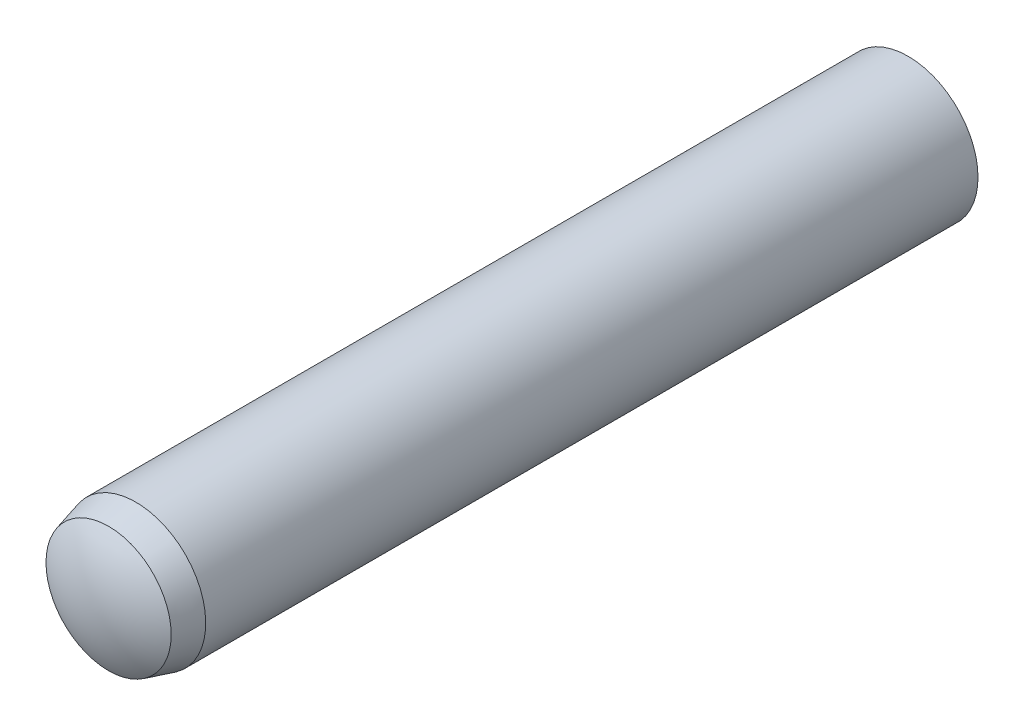
ISO-10303-21;
HEADER;
FILE_DESCRIPTION(('STEP AP214'),'2;1');
FILE_NAME('part.step','',(''),(''),'','','');
FILE_SCHEMA(('AUTOMOTIVE_DESIGN { 1 0 10303 214 1 1 1 1 }'));
ENDSEC;
DATA;
#1=APPLICATION_CONTEXT('core data for automotive mechanical design processes');
#2=APPLICATION_PROTOCOL_DEFINITION('international standard','automotive_design',2000,#1);
#3=PRODUCT_CONTEXT('',#1,'mechanical');
#4=PRODUCT('Part','Part','',(#3));
#5=PRODUCT_RELATED_PRODUCT_CATEGORY('part','',(#4));
#6=PRODUCT_DEFINITION_FORMATION('','',#4);
#7=PRODUCT_DEFINITION_CONTEXT('part definition',#1,'design');
#8=PRODUCT_DEFINITION('design','',#6,#7);
#9=PRODUCT_DEFINITION_SHAPE('','',#8);
#10=(LENGTH_UNIT() NAMED_UNIT(*) SI_UNIT(.MILLI.,.METRE.));
#11=(NAMED_UNIT(*) PLANE_ANGLE_UNIT() SI_UNIT($,.RADIAN.));
#12=(NAMED_UNIT(*) SI_UNIT($,.STERADIAN.) SOLID_ANGLE_UNIT());
#13=UNCERTAINTY_MEASURE_WITH_UNIT(LENGTH_MEASURE(1.E-05),#10,'distance_accuracy_value','');
#14=(GEOMETRIC_REPRESENTATION_CONTEXT(3) GLOBAL_UNCERTAINTY_ASSIGNED_CONTEXT((#13)) GLOBAL_UNIT_ASSIGNED_CONTEXT((#10,
#11,#12)) REPRESENTATION_CONTEXT('',''));
#15=CARTESIAN_POINT('',(0.,0.,0.));
#16=DIRECTION('',(0.,0.,1.));
#17=DIRECTION('',(1.,0.,0.));
#18=AXIS2_PLACEMENT_3D('',#15,#16,#17);
#19=CARTESIAN_POINT('',(0.,0.,-4.18333333333334));
#20=DIRECTION('',(0.,0.,1.));
#21=DIRECTION('',(0.,1.,0.));
#22=AXIS2_PLACEMENT_3D('',#19,#20,#21);
#23=SPHERICAL_SURFACE('',#22,1.81666666666666);
#24=CARTESIAN_POINT('',(0.,0.,-5.7));
#25=DIRECTION('',(0.,0.,1.));
#26=DIRECTION('',(0.,-1.,0.));
#27=AXIS2_PLACEMENT_3D('',#24,#25,#26);
#28=CIRCLE('',#27,0.999999999999998);
#29=CARTESIAN_POINT('',(0.,-0.999999999999997,-5.7));
#30=VERTEX_POINT('',#29);
#31=EDGE_CURVE('E10',#30,#30,#28,.T.);
#32=ORIENTED_EDGE('',*,*,#31,.F.);
#33=EDGE_LOOP('',(#32));
#34=FACE_BOUND('',#33,.T.);
#35=ADVANCED_FACE('F35',(#34),#23,.T.);
#36=CARTESIAN_POINT('',(0.,0.,6.));
#37=DIRECTION('',(0.,0.,1.));
#38=DIRECTION('',(0.,-1.,0.));
#39=AXIS2_PLACEMENT_3D('',#36,#37,#38);
#40=CYLINDRICAL_SURFACE('',#39,0.999999999999999);
#41=CARTESIAN_POINT('',(0.,0.,5.35));
#42=DIRECTION('',(0.,0.,1.));
#43=DIRECTION('',(0.,-1.,0.));
#44=AXIS2_PLACEMENT_3D('',#41,#42,#43);
#45=CIRCLE('',#44,1.);
#46=CARTESIAN_POINT('',(0.,-1.,5.35));
#47=VERTEX_POINT('',#46);
#48=EDGE_CURVE('E41',#47,#47,#45,.T.);
#49=ORIENTED_EDGE('',*,*,#48,.F.);
#50=EDGE_LOOP('',(#49));
#51=FACE_BOUND('',#50,.T.);
#52=ORIENTED_EDGE('',*,*,#31,.T.);
#53=EDGE_LOOP('',(#52));
#54=FACE_BOUND('',#53,.T.);
#55=ADVANCED_FACE('F56',(#51,#54),#40,.T.);
#56=CARTESIAN_POINT('',(0.,0.,5.35));
#57=DIRECTION('',(0.,0.,-1.));
#58=DIRECTION('',(0.,1.,0.));
#59=AXIS2_PLACEMENT_3D('',#56,#57,#58);
#60=CONICAL_SURFACE('',#59,1.,0.26179938779915);
#61=CARTESIAN_POINT('',(0.,0.,5.74));
#62=DIRECTION('',(0.,0.,1.));
#63=DIRECTION('',(0.,-1.,0.));
#64=AXIS2_PLACEMENT_3D('',#61,#62,#63);
#65=CIRCLE('',#64,0.895499814951862);
#66=CARTESIAN_POINT('',(0.,-0.895499814951862,5.74));
#67=VERTEX_POINT('',#66);
#68=EDGE_CURVE('E45',#67,#67,#65,.T.);
#69=ORIENTED_EDGE('',*,*,#68,.F.);
#70=EDGE_LOOP('',(#69));
#71=FACE_BOUND('',#70,.T.);
#72=ORIENTED_EDGE('',*,*,#48,.T.);
#73=EDGE_LOOP('',(#72));
#74=FACE_BOUND('',#73,.T.);
#75=ADVANCED_FACE('F54',(#71,#74),#60,.T.);
#76=CARTESIAN_POINT('',(0.,0.,4.32784631042535));
#77=DIRECTION('',(0.,0.,1.));
#78=DIRECTION('',(0.,1.,0.));
#79=AXIS2_PLACEMENT_3D('',#76,#77,#78);
#80=SPHERICAL_SURFACE('',#79,1.67215368957465);
#81=ORIENTED_EDGE('',*,*,#68,.T.);
#82=EDGE_LOOP('',(#81));
#83=FACE_BOUND('',#82,.T.);
#84=ADVANCED_FACE('F52',(#83),#80,.T.);
#85=CLOSED_SHELL('',(#35,#55,#75,#84));
#86=MANIFOLD_SOLID_BREP('B2',#85);
#87=ADVANCED_BREP_SHAPE_REPRESENTATION('',(#18,#86),#14);
#88=SHAPE_DEFINITION_REPRESENTATION(#9,#87);
ENDSEC;
END-ISO-10303-21;
